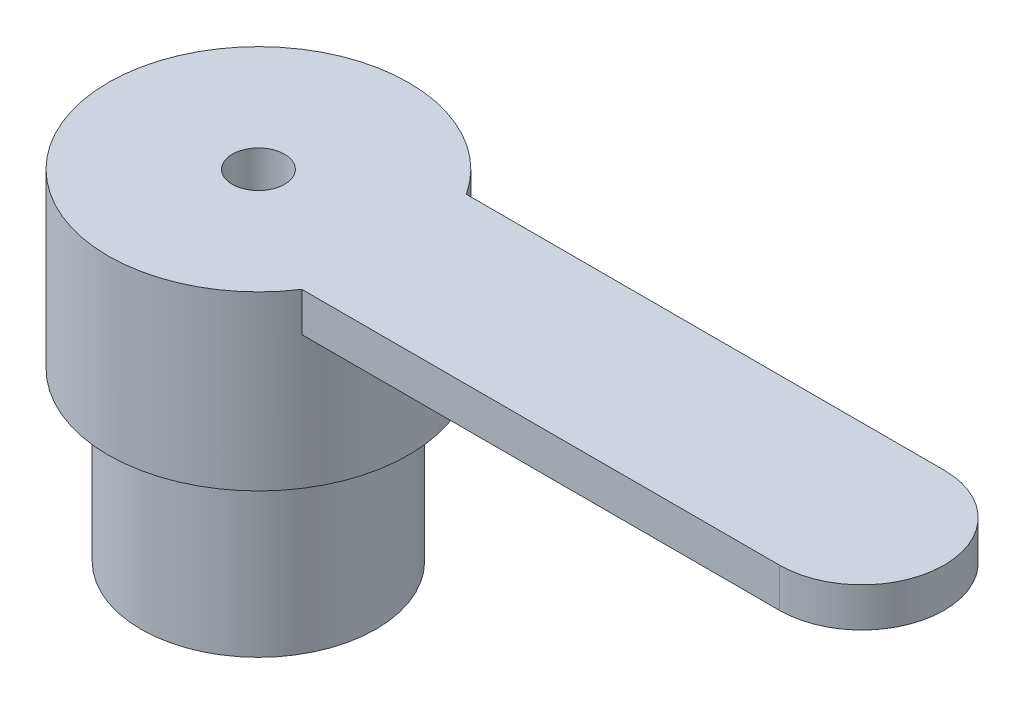
ISO-10303-21;
HEADER;
FILE_DESCRIPTION(('STEP AP214'),'2;1');
FILE_NAME('part.step','',(''),(''),'','','');
FILE_SCHEMA(('AUTOMOTIVE_DESIGN { 1 0 10303 214 1 1 1 1 }'));
ENDSEC;
DATA;
#1=APPLICATION_CONTEXT('core data for automotive mechanical design processes');
#2=APPLICATION_PROTOCOL_DEFINITION('international standard','automotive_design',2000,#1);
#3=PRODUCT_CONTEXT('',#1,'mechanical');
#4=PRODUCT('Part','Part','',(#3));
#5=PRODUCT_RELATED_PRODUCT_CATEGORY('part','',(#4));
#6=PRODUCT_DEFINITION_FORMATION('','',#4);
#7=PRODUCT_DEFINITION_CONTEXT('part definition',#1,'design');
#8=PRODUCT_DEFINITION('design','',#6,#7);
#9=PRODUCT_DEFINITION_SHAPE('','',#8);
#10=(LENGTH_UNIT() NAMED_UNIT(*) SI_UNIT(.MILLI.,.METRE.));
#11=(NAMED_UNIT(*) PLANE_ANGLE_UNIT() SI_UNIT($,.RADIAN.));
#12=(NAMED_UNIT(*) SI_UNIT($,.STERADIAN.) SOLID_ANGLE_UNIT());
#13=UNCERTAINTY_MEASURE_WITH_UNIT(LENGTH_MEASURE(1.E-05),#10,'distance_accuracy_value','');
#14=(GEOMETRIC_REPRESENTATION_CONTEXT(3) GLOBAL_UNCERTAINTY_ASSIGNED_CONTEXT((#13)) GLOBAL_UNIT_ASSIGNED_CONTEXT((#10,
#11,#12)) REPRESENTATION_CONTEXT('',''));
#15=CARTESIAN_POINT('',(0.,0.,0.));
#16=DIRECTION('',(0.,0.,1.));
#17=DIRECTION('',(1.,0.,0.));
#18=AXIS2_PLACEMENT_3D('',#15,#16,#17);
#19=CARTESIAN_POINT('',(0.,-2.55,0.));
#20=DIRECTION('',(0.,1.,0.));
#21=DIRECTION('',(0.,0.,1.));
#22=AXIS2_PLACEMENT_3D('',#19,#20,#21);
#23=PLANE('',#22);
#24=CARTESIAN_POINT('',(0.,-2.55,0.));
#25=DIRECTION('',(0.,1.,0.));
#26=DIRECTION('',(0.,0.,1.));
#27=AXIS2_PLACEMENT_3D('',#24,#25,#26);
#28=CIRCLE('',#27,2.875);
#29=CARTESIAN_POINT('',(0.,-2.55,2.875));
#30=VERTEX_POINT('',#29);
#31=EDGE_CURVE('E44',#30,#30,#28,.T.);
#32=ORIENTED_EDGE('',*,*,#31,.F.);
#33=EDGE_LOOP('',(#32));
#34=FACE_BOUND('',#33,.T.);
#35=CARTESIAN_POINT('',(0.,-2.55,0.));
#36=DIRECTION('',(0.,1.,0.));
#37=DIRECTION('',(0.,0.,1.));
#38=AXIS2_PLACEMENT_3D('',#35,#36,#37);
#39=CIRCLE('',#38,2.25);
#40=CARTESIAN_POINT('',(0.,-2.55,2.25));
#41=VERTEX_POINT('',#40);
#42=EDGE_CURVE('E11',#41,#41,#39,.F.);
#43=ORIENTED_EDGE('',*,*,#42,.F.);
#44=EDGE_LOOP('',(#43));
#45=FACE_BOUND('',#44,.T.);
#46=ADVANCED_FACE('F36',(#34,#45),#23,.F.);
#47=CARTESIAN_POINT('',(0.,-2.55,0.));
#48=DIRECTION('',(0.,1.,0.));
#49=DIRECTION('',(0.,0.,1.));
#50=AXIS2_PLACEMENT_3D('',#47,#48,#49);
#51=CYLINDRICAL_SURFACE('',#50,2.875);
#52=ORIENTED_EDGE('',*,*,#31,.T.);
#53=EDGE_LOOP('',(#52));
#54=FACE_BOUND('',#53,.T.);
#55=CARTESIAN_POINT('',(0.,0.,0.));
#56=DIRECTION('',(0.,1.,0.));
#57=DIRECTION('',(0.,0.,1.));
#58=AXIS2_PLACEMENT_3D('',#55,#56,#57);
#59=CIRCLE('',#58,2.875);
#60=CARTESIAN_POINT('',(2.40520269416114,0.,1.575));
#61=VERTEX_POINT('',#60);
#62=CARTESIAN_POINT('',(2.40520269416114,0.,-1.575));
#63=VERTEX_POINT('',#62);
#64=EDGE_CURVE('E51',#61,#63,#59,.T.);
#65=ORIENTED_EDGE('',*,*,#64,.F.);
#66=DIRECTION('',(0.,-1.,0.));
#67=VECTOR('',#66,1.);
#68=CARTESIAN_POINT('',(2.40520269416114,0.75,1.575));
#69=LINE('',#68,#67);
#70=CARTESIAN_POINT('',(2.40520269416114,0.75,1.575));
#71=VERTEX_POINT('',#70);
#72=EDGE_CURVE('E95',#71,#61,#69,.T.);
#73=ORIENTED_EDGE('',*,*,#72,.F.);
#74=CARTESIAN_POINT('',(0.,0.75,0.));
#75=DIRECTION('',(0.,1.,0.));
#76=DIRECTION('',(0.,0.,1.));
#77=AXIS2_PLACEMENT_3D('',#74,#75,#76);
#78=CIRCLE('',#77,2.875);
#79=CARTESIAN_POINT('',(2.40520269416114,0.75,-1.575));
#80=VERTEX_POINT('',#79);
#81=EDGE_CURVE('E81',#80,#71,#78,.T.);
#82=ORIENTED_EDGE('',*,*,#81,.F.);
#83=DIRECTION('',(0.,-1.,0.));
#84=VECTOR('',#83,1.);
#85=CARTESIAN_POINT('',(2.40520269416114,0.75,-1.575));
#86=LINE('',#85,#84);
#87=EDGE_CURVE('E59',#80,#63,#86,.T.);
#88=ORIENTED_EDGE('',*,*,#87,.T.);
#89=EDGE_LOOP('',(#65,#73,#82,#88));
#90=FACE_BOUND('',#89,.T.);
#91=ADVANCED_FACE('F38',(#54,#90),#51,.T.);
#92=CARTESIAN_POINT('',(0.,0.,0.));
#93=DIRECTION('',(0.,1.,0.));
#94=DIRECTION('',(0.,0.,1.));
#95=AXIS2_PLACEMENT_3D('',#92,#93,#94);
#96=PLANE('',#95);
#97=DIRECTION('',(-1.,0.,0.));
#98=VECTOR('',#97,1.);
#99=CARTESIAN_POINT('',(0.,0.,1.575));
#100=LINE('',#99,#98);
#101=CARTESIAN_POINT('',(11.55,0.,1.575));
#102=VERTEX_POINT('',#101);
#103=EDGE_CURVE('E92',#102,#61,#100,.T.);
#104=ORIENTED_EDGE('',*,*,#103,.T.);
#105=ORIENTED_EDGE('',*,*,#64,.T.);
#106=DIRECTION('',(1.,0.,0.));
#107=VECTOR('',#106,1.);
#108=CARTESIAN_POINT('',(0.,0.,-1.575));
#109=LINE('',#108,#107);
#110=CARTESIAN_POINT('',(11.55,0.,-1.575));
#111=VERTEX_POINT('',#110);
#112=EDGE_CURVE('E103',#63,#111,#109,.T.);
#113=ORIENTED_EDGE('',*,*,#112,.T.);
#114=CARTESIAN_POINT('',(11.55,0.,0.));
#115=DIRECTION('',(0.,1.,0.));
#116=DIRECTION('',(0.,0.,1.));
#117=AXIS2_PLACEMENT_3D('',#114,#115,#116);
#118=CIRCLE('',#117,1.575);
#119=EDGE_CURVE('E108',#102,#111,#118,.T.);
#120=ORIENTED_EDGE('',*,*,#119,.F.);
#121=EDGE_LOOP('',(#104,#105,#113,#120));
#122=FACE_BOUND('',#121,.T.);
#123=ADVANCED_FACE('F127',(#122),#96,.F.);
#124=CARTESIAN_POINT('',(0.,0.75,1.575));
#125=DIRECTION('',(0.,0.,1.));
#126=DIRECTION('',(1.,0.,0.));
#127=AXIS2_PLACEMENT_3D('',#124,#125,#126);
#128=PLANE('',#127);
#129=ORIENTED_EDGE('',*,*,#103,.F.);
#130=DIRECTION('',(0.,-1.,0.));
#131=VECTOR('',#130,1.);
#132=CARTESIAN_POINT('',(11.55,0.75,1.575));
#133=LINE('',#132,#131);
#134=CARTESIAN_POINT('',(11.55,0.75,1.575));
#135=VERTEX_POINT('',#134);
#136=EDGE_CURVE('E87',#135,#102,#133,.T.);
#137=ORIENTED_EDGE('',*,*,#136,.F.);
#138=DIRECTION('',(-1.,0.,0.));
#139=VECTOR('',#138,1.);
#140=CARTESIAN_POINT('',(0.,0.75,1.575));
#141=LINE('',#140,#139);
#142=EDGE_CURVE('E91',#135,#71,#141,.T.);
#143=ORIENTED_EDGE('',*,*,#142,.T.);
#144=ORIENTED_EDGE('',*,*,#72,.T.);
#145=EDGE_LOOP('',(#129,#137,#143,#144));
#146=FACE_BOUND('',#145,.T.);
#147=ADVANCED_FACE('F89',(#146),#128,.T.);
#148=CARTESIAN_POINT('',(11.55,0.75,0.));
#149=DIRECTION('',(0.,-1.,0.));
#150=DIRECTION('',(0.,0.,-1.));
#151=AXIS2_PLACEMENT_3D('',#148,#149,#150);
#152=CYLINDRICAL_SURFACE('',#151,1.575);
#153=ORIENTED_EDGE('',*,*,#119,.T.);
#154=DIRECTION('',(0.,-1.,0.));
#155=VECTOR('',#154,1.);
#156=CARTESIAN_POINT('',(11.55,0.75,-1.575));
#157=LINE('',#156,#155);
#158=CARTESIAN_POINT('',(11.55,0.75,-1.575));
#159=VERTEX_POINT('',#158);
#160=EDGE_CURVE('E74',#159,#111,#157,.T.);
#161=ORIENTED_EDGE('',*,*,#160,.F.);
#162=CARTESIAN_POINT('',(11.55,0.75,0.));
#163=DIRECTION('',(0.,1.,0.));
#164=DIRECTION('',(0.,0.,1.));
#165=AXIS2_PLACEMENT_3D('',#162,#163,#164);
#166=CIRCLE('',#165,1.575);
#167=EDGE_CURVE('E97',#135,#159,#166,.T.);
#168=ORIENTED_EDGE('',*,*,#167,.F.);
#169=ORIENTED_EDGE('',*,*,#136,.T.);
#170=EDGE_LOOP('',(#153,#161,#168,#169));
#171=FACE_BOUND('',#170,.T.);
#172=ADVANCED_FACE('F98',(#171),#152,.T.);
#173=CARTESIAN_POINT('',(0.,0.75,-1.575));
#174=DIRECTION('',(0.,0.,-1.));
#175=DIRECTION('',(-1.,0.,0.));
#176=AXIS2_PLACEMENT_3D('',#173,#174,#175);
#177=PLANE('',#176);
#178=ORIENTED_EDGE('',*,*,#112,.F.);
#179=ORIENTED_EDGE('',*,*,#87,.F.);
#180=DIRECTION('',(1.,0.,0.));
#181=VECTOR('',#180,1.);
#182=CARTESIAN_POINT('',(0.,0.75,-1.575));
#183=LINE('',#182,#181);
#184=EDGE_CURVE('E99',#80,#159,#183,.T.);
#185=ORIENTED_EDGE('',*,*,#184,.T.);
#186=ORIENTED_EDGE('',*,*,#160,.T.);
#187=EDGE_LOOP('',(#178,#179,#185,#186));
#188=FACE_BOUND('',#187,.T.);
#189=ADVANCED_FACE('F128',(#188),#177,.T.);
#190=CARTESIAN_POINT('',(0.,0.75,0.));
#191=DIRECTION('',(0.,1.,0.));
#192=DIRECTION('',(0.,0.,1.));
#193=AXIS2_PLACEMENT_3D('',#190,#191,#192);
#194=PLANE('',#193);
#195=CARTESIAN_POINT('',(0.,0.75,0.));
#196=DIRECTION('',(0.,1.,0.));
#197=DIRECTION('',(0.,0.,1.));
#198=AXIS2_PLACEMENT_3D('',#195,#196,#197);
#199=CIRCLE('',#198,0.5);
#200=CARTESIAN_POINT('',(0.,0.75,0.5));
#201=VERTEX_POINT('',#200);
#202=EDGE_CURVE('E171',#201,#201,#199,.T.);
#203=ORIENTED_EDGE('',*,*,#202,.F.);
#204=EDGE_LOOP('',(#203));
#205=FACE_BOUND('',#204,.T.);
#206=ORIENTED_EDGE('',*,*,#81,.T.);
#207=ORIENTED_EDGE('',*,*,#142,.F.);
#208=ORIENTED_EDGE('',*,*,#167,.T.);
#209=ORIENTED_EDGE('',*,*,#184,.F.);
#210=EDGE_LOOP('',(#206,#207,#208,#209));
#211=FACE_BOUND('',#210,.T.);
#212=ADVANCED_FACE('F101',(#205,#211),#194,.T.);
#213=CARTESIAN_POINT('',(0.,-5.75,0.));
#214=DIRECTION('',(0.,1.,0.));
#215=DIRECTION('',(0.,0.,1.));
#216=AXIS2_PLACEMENT_3D('',#213,#214,#215);
#217=CYLINDRICAL_SURFACE('',#216,2.25);
#218=CARTESIAN_POINT('',(0.,-5.75,0.));
#219=DIRECTION('',(0.,-1.,0.));
#220=DIRECTION('',(0.,0.,-1.));
#221=AXIS2_PLACEMENT_3D('',#218,#219,#220);
#222=CIRCLE('',#221,2.25);
#223=CARTESIAN_POINT('',(0.,-5.75,-2.25));
#224=VERTEX_POINT('',#223);
#225=EDGE_CURVE('E120',#224,#224,#222,.T.);
#226=ORIENTED_EDGE('',*,*,#225,.F.);
#227=EDGE_LOOP('',(#226));
#228=FACE_BOUND('',#227,.T.);
#229=ORIENTED_EDGE('',*,*,#42,.T.);
#230=EDGE_LOOP('',(#229));
#231=FACE_BOUND('',#230,.T.);
#232=ADVANCED_FACE('F135',(#228,#231),#217,.T.);
#233=CARTESIAN_POINT('',(0.,-5.75,0.));
#234=DIRECTION('',(0.,-1.,0.));
#235=DIRECTION('',(0.,0.,-1.));
#236=AXIS2_PLACEMENT_3D('',#233,#234,#235);
#237=PLANE('',#236);
#238=CARTESIAN_POINT('',(0.,-5.75,0.));
#239=DIRECTION('',(0.,-1.,0.));
#240=DIRECTION('',(0.,0.,-1.));
#241=AXIS2_PLACEMENT_3D('',#238,#239,#240);
#242=CIRCLE('',#241,0.5);
#243=CARTESIAN_POINT('',(0.,-5.75,-0.5));
#244=VERTEX_POINT('',#243);
#245=EDGE_CURVE('E174',#244,#244,#242,.T.);
#246=ORIENTED_EDGE('',*,*,#245,.F.);
#247=EDGE_LOOP('',(#246));
#248=FACE_BOUND('',#247,.T.);
#249=ORIENTED_EDGE('',*,*,#225,.T.);
#250=EDGE_LOOP('',(#249));
#251=FACE_BOUND('',#250,.T.);
#252=ADVANCED_FACE('F158',(#248,#251),#237,.T.);
#253=CARTESIAN_POINT('',(0.,0.750025,0.));
#254=DIRECTION('',(0.,-1.,0.));
#255=DIRECTION('',(0.,0.,-1.));
#256=AXIS2_PLACEMENT_3D('',#253,#254,#255);
#257=CYLINDRICAL_SURFACE('',#256,0.5);
#258=ORIENTED_EDGE('',*,*,#202,.T.);
#259=EDGE_LOOP('',(#258));
#260=FACE_BOUND('',#259,.T.);
#261=ORIENTED_EDGE('',*,*,#245,.T.);
#262=EDGE_LOOP('',(#261));
#263=FACE_BOUND('',#262,.T.);
#264=ADVANCED_FACE('F162',(#260,#263),#257,.F.);
#265=CLOSED_SHELL('',(#46,#91,#123,#147,#172,#189,#212,#232,#252,#264));
#266=MANIFOLD_SOLID_BREP('B2',#265);
#267=ADVANCED_BREP_SHAPE_REPRESENTATION('',(#18,#266),#14);
#268=SHAPE_DEFINITION_REPRESENTATION(#9,#267);
ENDSEC;
END-ISO-10303-21;
